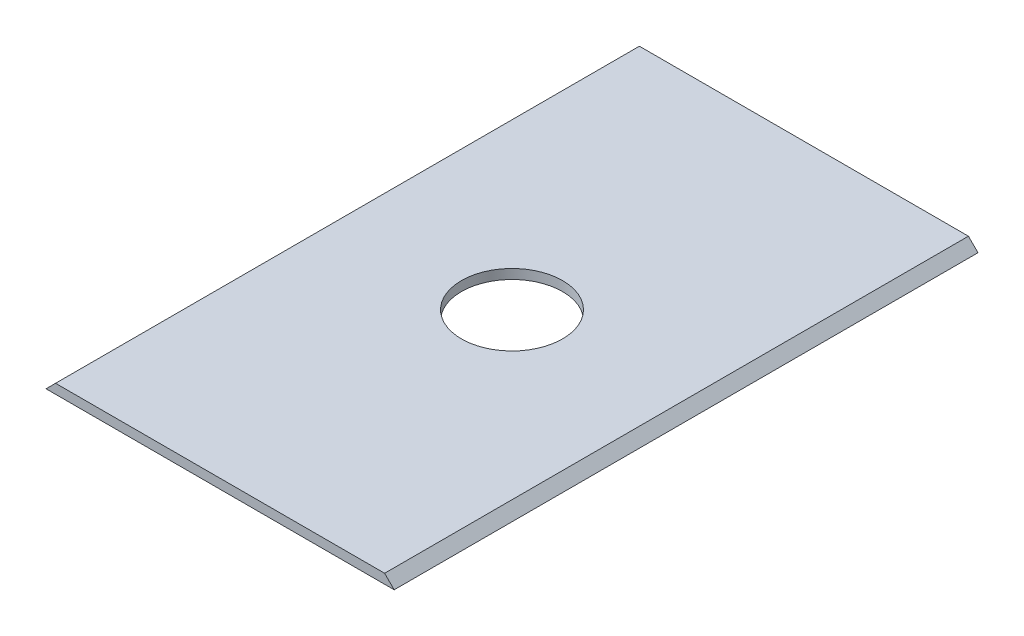
ISO-10303-21;
HEADER;
FILE_DESCRIPTION(('STEP AP214'),'2;1');
FILE_NAME('part.step','',(''),(''),'','','');
FILE_SCHEMA(('AUTOMOTIVE_DESIGN { 1 0 10303 214 1 1 1 1 }'));
ENDSEC;
DATA;
#1=APPLICATION_CONTEXT('core data for automotive mechanical design processes');
#2=APPLICATION_PROTOCOL_DEFINITION('international standard','automotive_design',2000,#1);
#3=PRODUCT_CONTEXT('',#1,'mechanical');
#4=PRODUCT('Part','Part','',(#3));
#5=PRODUCT_RELATED_PRODUCT_CATEGORY('part','',(#4));
#6=PRODUCT_DEFINITION_FORMATION('','',#4);
#7=PRODUCT_DEFINITION_CONTEXT('part definition',#1,'design');
#8=PRODUCT_DEFINITION('design','',#6,#7);
#9=PRODUCT_DEFINITION_SHAPE('','',#8);
#10=(LENGTH_UNIT() NAMED_UNIT(*) SI_UNIT(.MILLI.,.METRE.));
#11=(NAMED_UNIT(*) PLANE_ANGLE_UNIT() SI_UNIT($,.RADIAN.));
#12=(NAMED_UNIT(*) SI_UNIT($,.STERADIAN.) SOLID_ANGLE_UNIT());
#13=UNCERTAINTY_MEASURE_WITH_UNIT(LENGTH_MEASURE(1.E-05),#10,'distance_accuracy_value','');
#14=(GEOMETRIC_REPRESENTATION_CONTEXT(3) GLOBAL_UNCERTAINTY_ASSIGNED_CONTEXT((#13)) GLOBAL_UNIT_ASSIGNED_CONTEXT((#10,
#11,#12)) REPRESENTATION_CONTEXT('',''));
#15=CARTESIAN_POINT('',(0.,0.,0.));
#16=DIRECTION('',(0.,0.,1.));
#17=DIRECTION('',(1.,0.,0.));
#18=AXIS2_PLACEMENT_3D('',#15,#16,#17);
#19=CARTESIAN_POINT('',(1.80000000000001,1.79999999999999,110.));
#20=DIRECTION('',(0.707106781186544,-0.707106781186551,0.));
#21=DIRECTION('',(0.707106781186551,0.707106781186544,0.));
#22=AXIS2_PLACEMENT_3D('',#19,#20,#21);
#23=PLANE('',#22);
#24=DIRECTION('',(-0.707106781186551,-0.707106781186544,0.));
#25=VECTOR('',#24,1.);
#26=CARTESIAN_POINT('',(1.80000000000001,1.79999999999999,0.));
#27=LINE('',#26,#25);
#28=CARTESIAN_POINT('',(1.80000000000001,1.79999999999999,0.));
#29=VERTEX_POINT('',#28);
#30=CARTESIAN_POINT('',(0.,0.,0.));
#31=VERTEX_POINT('',#30);
#32=EDGE_CURVE('E111',#29,#31,#27,.T.);
#33=ORIENTED_EDGE('',*,*,#32,.T.);
#34=DIRECTION('',(0.,0.,-1.));
#35=VECTOR('',#34,1.);
#36=CARTESIAN_POINT('',(0.,0.,110.));
#37=LINE('',#36,#35);
#38=CARTESIAN_POINT('',(0.,0.,110.));
#39=VERTEX_POINT('',#38);
#40=EDGE_CURVE('E11',#39,#31,#37,.T.);
#41=ORIENTED_EDGE('',*,*,#40,.F.);
#42=DIRECTION('',(-0.707106781186551,-0.707106781186544,0.));
#43=VECTOR('',#42,1.);
#44=CARTESIAN_POINT('',(1.80000000000001,1.79999999999999,110.));
#45=LINE('',#44,#43);
#46=CARTESIAN_POINT('',(1.80000000000001,1.79999999999999,110.));
#47=VERTEX_POINT('',#46);
#48=EDGE_CURVE('E95',#47,#39,#45,.T.);
#49=ORIENTED_EDGE('',*,*,#48,.F.);
#50=DIRECTION('',(0.,0.,-1.));
#51=VECTOR('',#50,1.);
#52=CARTESIAN_POINT('',(1.80000000000001,1.79999999999999,110.));
#53=LINE('',#52,#51);
#54=EDGE_CURVE('E107',#47,#29,#53,.T.);
#55=ORIENTED_EDGE('',*,*,#54,.T.);
#56=EDGE_LOOP('',(#33,#41,#49,#55));
#57=FACE_BOUND('',#56,.T.);
#58=ADVANCED_FACE('F43',(#57),#23,.F.);
#59=CARTESIAN_POINT('',(0.,0.,110.));
#60=DIRECTION('',(0.,1.,0.));
#61=DIRECTION('',(0.,0.,1.));
#62=AXIS2_PLACEMENT_3D('',#59,#60,#61);
#63=PLANE('',#62);
#64=CARTESIAN_POINT('',(32.8,0.,55.));
#65=DIRECTION('',(0.,1.,0.));
#66=DIRECTION('',(-1.,0.,0.));
#67=AXIS2_PLACEMENT_3D('',#64,#65,#66);
#68=CIRCLE('',#67,9.525);
#69=CARTESIAN_POINT('',(23.275,0.,55.));
#70=VERTEX_POINT('',#69);
#71=EDGE_CURVE('E115',#70,#70,#68,.T.);
#72=ORIENTED_EDGE('',*,*,#71,.T.);
#73=EDGE_LOOP('',(#72));
#74=FACE_BOUND('',#73,.T.);
#75=DIRECTION('',(1.,0.,0.));
#76=VECTOR('',#75,1.);
#77=CARTESIAN_POINT('',(0.,0.,0.));
#78=LINE('',#77,#76);
#79=CARTESIAN_POINT('',(65.6,0.,0.));
#80=VERTEX_POINT('',#79);
#81=EDGE_CURVE('E100',#31,#80,#78,.T.);
#82=ORIENTED_EDGE('',*,*,#81,.T.);
#83=DIRECTION('',(0.,0.,-1.));
#84=VECTOR('',#83,1.);
#85=CARTESIAN_POINT('',(65.6,0.,110.));
#86=LINE('',#85,#84);
#87=CARTESIAN_POINT('',(65.6,0.,110.));
#88=VERTEX_POINT('',#87);
#89=EDGE_CURVE('E52',#88,#80,#86,.T.);
#90=ORIENTED_EDGE('',*,*,#89,.F.);
#91=DIRECTION('',(1.,0.,0.));
#92=VECTOR('',#91,1.);
#93=CARTESIAN_POINT('',(0.,0.,110.));
#94=LINE('',#93,#92);
#95=EDGE_CURVE('E90',#39,#88,#94,.T.);
#96=ORIENTED_EDGE('',*,*,#95,.F.);
#97=ORIENTED_EDGE('',*,*,#40,.T.);
#98=EDGE_LOOP('',(#82,#90,#96,#97));
#99=FACE_BOUND('',#98,.T.);
#100=ADVANCED_FACE('F99',(#74,#99),#63,.F.);
#101=CARTESIAN_POINT('',(65.6,0.,110.));
#102=DIRECTION('',(-0.707106781186546,-0.707106781186549,0.));
#103=DIRECTION('',(0.707106781186549,-0.707106781186546,0.));
#104=AXIS2_PLACEMENT_3D('',#101,#102,#103);
#105=PLANE('',#104);
#106=DIRECTION('',(-0.707106781186549,0.707106781186545,0.));
#107=VECTOR('',#106,1.);
#108=CARTESIAN_POINT('',(65.6,0.,0.));
#109=LINE('',#108,#107);
#110=CARTESIAN_POINT('',(63.8,1.8,0.));
#111=VERTEX_POINT('',#110);
#112=EDGE_CURVE('E77',#80,#111,#109,.T.);
#113=ORIENTED_EDGE('',*,*,#112,.T.);
#114=DIRECTION('',(0.,0.,-1.));
#115=VECTOR('',#114,1.);
#116=CARTESIAN_POINT('',(63.8,1.8,110.));
#117=LINE('',#116,#115);
#118=CARTESIAN_POINT('',(63.8,1.8,110.));
#119=VERTEX_POINT('',#118);
#120=EDGE_CURVE('E102',#119,#111,#117,.T.);
#121=ORIENTED_EDGE('',*,*,#120,.F.);
#122=DIRECTION('',(-0.707106781186549,0.707106781186545,0.));
#123=VECTOR('',#122,1.);
#124=CARTESIAN_POINT('',(65.6,0.,110.));
#125=LINE('',#124,#123);
#126=EDGE_CURVE('E93',#88,#119,#125,.T.);
#127=ORIENTED_EDGE('',*,*,#126,.F.);
#128=ORIENTED_EDGE('',*,*,#89,.T.);
#129=EDGE_LOOP('',(#113,#121,#127,#128));
#130=FACE_BOUND('',#129,.T.);
#131=ADVANCED_FACE('F103',(#130),#105,.F.);
#132=CARTESIAN_POINT('',(63.8,1.8,110.));
#133=DIRECTION('',(0.,-1.,0.));
#134=DIRECTION('',(1.,0.,0.));
#135=AXIS2_PLACEMENT_3D('',#132,#133,#134);
#136=PLANE('',#135);
#137=CARTESIAN_POINT('',(32.8,1.8,55.));
#138=DIRECTION('',(0.,1.,0.));
#139=DIRECTION('',(-1.,0.,0.));
#140=AXIS2_PLACEMENT_3D('',#137,#138,#139);
#141=CIRCLE('',#140,9.525);
#142=CARTESIAN_POINT('',(23.275,1.79999999999999,55.));
#143=VERTEX_POINT('',#142);
#144=EDGE_CURVE('E132',#143,#143,#141,.T.);
#145=ORIENTED_EDGE('',*,*,#144,.F.);
#146=EDGE_LOOP('',(#145));
#147=FACE_BOUND('',#146,.T.);
#148=DIRECTION('',(-1.,0.,0.));
#149=VECTOR('',#148,1.);
#150=CARTESIAN_POINT('',(63.8,1.8,0.));
#151=LINE('',#150,#149);
#152=EDGE_CURVE('E83',#111,#29,#151,.T.);
#153=ORIENTED_EDGE('',*,*,#152,.T.);
#154=ORIENTED_EDGE('',*,*,#54,.F.);
#155=DIRECTION('',(-1.,0.,0.));
#156=VECTOR('',#155,1.);
#157=CARTESIAN_POINT('',(63.8,1.8,110.));
#158=LINE('',#157,#156);
#159=EDGE_CURVE('E60',#119,#47,#158,.T.);
#160=ORIENTED_EDGE('',*,*,#159,.F.);
#161=ORIENTED_EDGE('',*,*,#120,.T.);
#162=EDGE_LOOP('',(#153,#154,#160,#161));
#163=FACE_BOUND('',#162,.T.);
#164=ADVANCED_FACE('F125',(#147,#163),#136,.F.);
#165=CARTESIAN_POINT('',(0.,0.,110.));
#166=DIRECTION('',(0.,0.,-1.));
#167=DIRECTION('',(-1.,0.,0.));
#168=AXIS2_PLACEMENT_3D('',#165,#166,#167);
#169=PLANE('',#168);
#170=ORIENTED_EDGE('',*,*,#48,.T.);
#171=ORIENTED_EDGE('',*,*,#95,.T.);
#172=ORIENTED_EDGE('',*,*,#126,.T.);
#173=ORIENTED_EDGE('',*,*,#159,.T.);
#174=EDGE_LOOP('',(#170,#171,#172,#173));
#175=FACE_BOUND('',#174,.T.);
#176=ADVANCED_FACE('F91',(#175),#169,.F.);
#177=CARTESIAN_POINT('',(0.,0.,0.));
#178=DIRECTION('',(0.,0.,-1.));
#179=DIRECTION('',(-1.,0.,0.));
#180=AXIS2_PLACEMENT_3D('',#177,#178,#179);
#181=PLANE('',#180);
#182=ORIENTED_EDGE('',*,*,#32,.F.);
#183=ORIENTED_EDGE('',*,*,#152,.F.);
#184=ORIENTED_EDGE('',*,*,#112,.F.);
#185=ORIENTED_EDGE('',*,*,#81,.F.);
#186=EDGE_LOOP('',(#182,#183,#184,#185));
#187=FACE_BOUND('',#186,.T.);
#188=ADVANCED_FACE('F128',(#187),#181,.T.);
#189=CARTESIAN_POINT('',(32.8,0.,55.));
#190=DIRECTION('',(0.,1.,0.));
#191=DIRECTION('',(-1.,0.,0.));
#192=AXIS2_PLACEMENT_3D('',#189,#190,#191);
#193=CYLINDRICAL_SURFACE('',#192,9.525);
#194=ORIENTED_EDGE('',*,*,#71,.F.);
#195=EDGE_LOOP('',(#194));
#196=FACE_BOUND('',#195,.T.);
#197=ORIENTED_EDGE('',*,*,#144,.T.);
#198=EDGE_LOOP('',(#197));
#199=FACE_BOUND('',#198,.T.);
#200=ADVANCED_FACE('F141',(#196,#199),#193,.F.);
#201=CLOSED_SHELL('',(#58,#100,#131,#164,#176,#188,#200));
#202=MANIFOLD_SOLID_BREP('B2',#201);
#203=ADVANCED_BREP_SHAPE_REPRESENTATION('',(#18,#202),#14);
#204=SHAPE_DEFINITION_REPRESENTATION(#9,#203);
ENDSEC;
END-ISO-10303-21;
